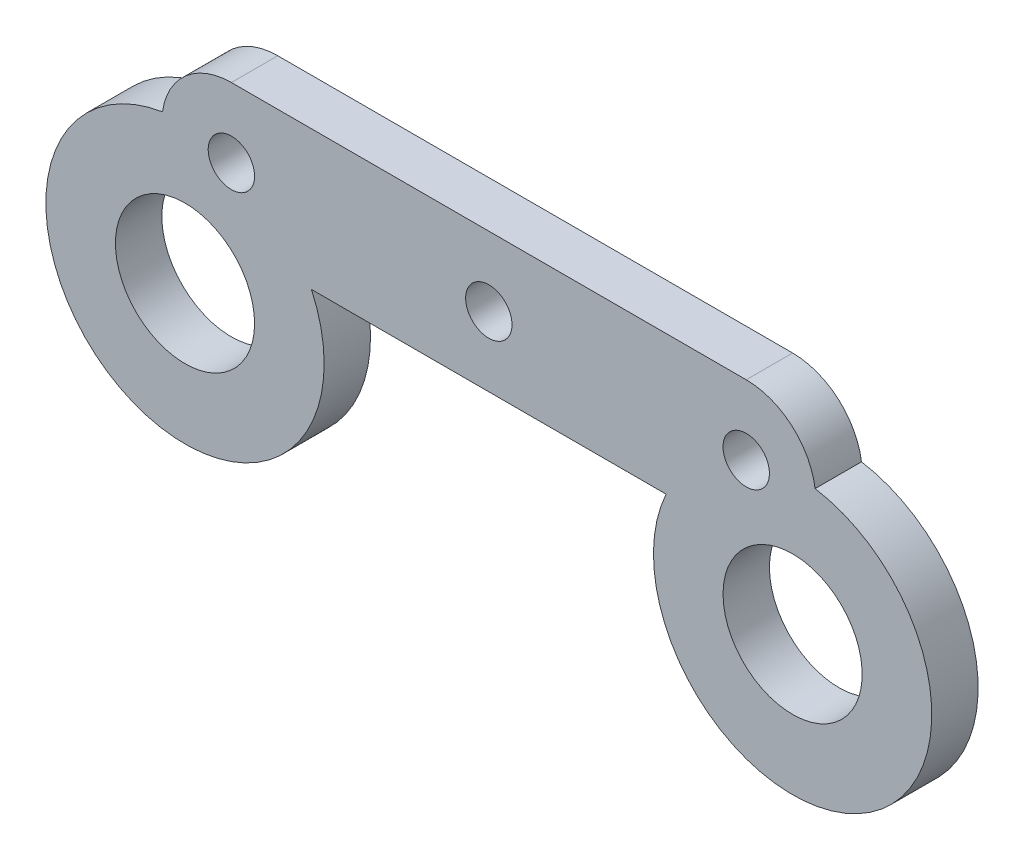
ISO-10303-21;
HEADER;
FILE_DESCRIPTION(('STEP AP214'),'2;1');
FILE_NAME('part.step','',(''),(''),'','','');
FILE_SCHEMA(('AUTOMOTIVE_DESIGN { 1 0 10303 214 1 1 1 1 }'));
ENDSEC;
DATA;
#1=APPLICATION_CONTEXT('core data for automotive mechanical design processes');
#2=APPLICATION_PROTOCOL_DEFINITION('international standard','automotive_design',2000,#1);
#3=PRODUCT_CONTEXT('',#1,'mechanical');
#4=PRODUCT('Part','Part','',(#3));
#5=PRODUCT_RELATED_PRODUCT_CATEGORY('part','',(#4));
#6=PRODUCT_DEFINITION_FORMATION('','',#4);
#7=PRODUCT_DEFINITION_CONTEXT('part definition',#1,'design');
#8=PRODUCT_DEFINITION('design','',#6,#7);
#9=PRODUCT_DEFINITION_SHAPE('','',#8);
#10=(LENGTH_UNIT() NAMED_UNIT(*) SI_UNIT(.MILLI.,.METRE.));
#11=(NAMED_UNIT(*) PLANE_ANGLE_UNIT() SI_UNIT($,.RADIAN.));
#12=(NAMED_UNIT(*) SI_UNIT($,.STERADIAN.) SOLID_ANGLE_UNIT());
#13=UNCERTAINTY_MEASURE_WITH_UNIT(LENGTH_MEASURE(1.E-05),#10,'distance_accuracy_value','');
#14=(GEOMETRIC_REPRESENTATION_CONTEXT(3) GLOBAL_UNCERTAINTY_ASSIGNED_CONTEXT((#13)) GLOBAL_UNIT_ASSIGNED_CONTEXT((#10,
#11,#12)) REPRESENTATION_CONTEXT('',''));
#15=CARTESIAN_POINT('',(0.,0.,0.));
#16=DIRECTION('',(0.,0.,1.));
#17=DIRECTION('',(1.,0.,0.));
#18=AXIS2_PLACEMENT_3D('',#15,#16,#17);
#19=CARTESIAN_POINT('',(11.1001903742504,0.,2.));
#20=DIRECTION('',(0.,0.,1.));
#21=DIRECTION('',(1.,0.,0.));
#22=AXIS2_PLACEMENT_3D('',#19,#20,#21);
#23=PLANE('',#22);
#24=CARTESIAN_POINT('',(-11.1001903742504,0.,2.));
#25=DIRECTION('',(0.,0.,1.));
#26=DIRECTION('',(1.,0.,0.));
#27=AXIS2_PLACEMENT_3D('',#24,#25,#26);
#28=CIRCLE('',#27,0.99999999999969);
#29=CARTESIAN_POINT('',(-10.1001903742507,0.,2.));
#30=VERTEX_POINT('',#29);
#31=EDGE_CURVE('E205',#30,#30,#28,.T.);
#32=ORIENTED_EDGE('',*,*,#31,.F.);
#33=EDGE_LOOP('',(#32));
#34=FACE_BOUND('',#33,.T.);
#35=CARTESIAN_POINT('',(13.1001903742511,-5.49999999999931,2.));
#36=DIRECTION('',(0.,0.,1.));
#37=DIRECTION('',(-1.,0.,0.));
#38=AXIS2_PLACEMENT_3D('',#35,#36,#37);
#39=CIRCLE('',#38,3.);
#40=CARTESIAN_POINT('',(10.1001903742511,-5.49999999999931,2.));
#41=VERTEX_POINT('',#40);
#42=EDGE_CURVE('E217',#41,#41,#39,.T.);
#43=ORIENTED_EDGE('',*,*,#42,.F.);
#44=EDGE_LOOP('',(#43));
#45=FACE_BOUND('',#44,.T.);
#46=CARTESIAN_POINT('',(11.1001903742504,0.,2.));
#47=DIRECTION('',(0.,0.,1.));
#48=DIRECTION('',(1.,0.,0.));
#49=AXIS2_PLACEMENT_3D('',#46,#47,#48);
#50=CIRCLE('',#49,3.);
#51=CARTESIAN_POINT('',(14.0705002353822,0.421021767683334,2.));
#52=VERTEX_POINT('',#51);
#53=CARTESIAN_POINT('',(11.1001903742504,3.,2.));
#54=VERTEX_POINT('',#53);
#55=EDGE_CURVE('E128',#52,#54,#50,.T.);
#56=ORIENTED_EDGE('',*,*,#55,.T.);
#57=DIRECTION('',(-1.,0.,0.));
#58=VECTOR('',#57,1.);
#59=CARTESIAN_POINT('',(-11.1001903742504,3.,2.));
#60=LINE('',#59,#58);
#61=CARTESIAN_POINT('',(-11.1001903742504,3.,2.));
#62=VERTEX_POINT('',#61);
#63=EDGE_CURVE('E86',#54,#62,#60,.T.);
#64=ORIENTED_EDGE('',*,*,#63,.T.);
#65=CARTESIAN_POINT('',(-11.1001903742504,0.,2.));
#66=DIRECTION('',(0.,0.,1.));
#67=DIRECTION('',(1.,0.,0.));
#68=AXIS2_PLACEMENT_3D('',#65,#66,#67);
#69=CIRCLE('',#68,3.);
#70=CARTESIAN_POINT('',(-14.0705002353822,0.421021767683246,2.));
#71=VERTEX_POINT('',#70);
#72=EDGE_CURVE('E99',#62,#71,#69,.T.);
#73=ORIENTED_EDGE('',*,*,#72,.T.);
#74=CARTESIAN_POINT('',(-13.100190374251,-5.49999999999942,2.));
#75=DIRECTION('',(0.,0.,1.));
#76=DIRECTION('',(1.,0.,0.));
#77=AXIS2_PLACEMENT_3D('',#74,#75,#76);
#78=CIRCLE('',#77,5.99999999999837);
#79=CARTESIAN_POINT('',(-7.64583431693467,-3.,2.));
#80=VERTEX_POINT('',#79);
#81=EDGE_CURVE('E93',#71,#80,#78,.T.);
#82=ORIENTED_EDGE('',*,*,#81,.T.);
#83=DIRECTION('',(1.,0.,0.));
#84=VECTOR('',#83,1.);
#85=CARTESIAN_POINT('',(-7.64583431693467,-3.,2.));
#86=LINE('',#85,#84);
#87=CARTESIAN_POINT('',(7.64583431693468,-3.,2.));
#88=VERTEX_POINT('',#87);
#89=EDGE_CURVE('E97',#80,#88,#86,.T.);
#90=ORIENTED_EDGE('',*,*,#89,.T.);
#91=CARTESIAN_POINT('',(13.1001903742511,-5.49999999999931,2.));
#92=DIRECTION('',(0.,0.,1.));
#93=DIRECTION('',(1.,0.,0.));
#94=AXIS2_PLACEMENT_3D('',#91,#92,#93);
#95=CIRCLE('',#94,5.99999999999833);
#96=EDGE_CURVE('E49',#88,#52,#95,.T.);
#97=ORIENTED_EDGE('',*,*,#96,.T.);
#98=EDGE_LOOP('',(#56,#64,#73,#82,#90,#97));
#99=FACE_BOUND('',#98,.T.);
#100=CARTESIAN_POINT('',(0.,0.,2.));
#101=DIRECTION('',(0.,0.,1.));
#102=DIRECTION('',(1.,0.,0.));
#103=AXIS2_PLACEMENT_3D('',#100,#101,#102);
#104=CIRCLE('',#103,1.);
#105=CARTESIAN_POINT('',(1.,0.,2.));
#106=VERTEX_POINT('',#105);
#107=EDGE_CURVE('E121',#106,#106,#104,.T.);
#108=ORIENTED_EDGE('',*,*,#107,.F.);
#109=EDGE_LOOP('',(#108));
#110=FACE_BOUND('',#109,.T.);
#111=CARTESIAN_POINT('',(-13.100190374251,-5.49999999999942,2.));
#112=DIRECTION('',(0.,0.,1.));
#113=DIRECTION('',(1.,0.,0.));
#114=AXIS2_PLACEMENT_3D('',#111,#112,#113);
#115=CIRCLE('',#114,3.);
#116=CARTESIAN_POINT('',(-10.100190374251,-5.49999999999942,2.));
#117=VERTEX_POINT('',#116);
#118=EDGE_CURVE('E211',#117,#117,#115,.T.);
#119=ORIENTED_EDGE('',*,*,#118,.F.);
#120=EDGE_LOOP('',(#119));
#121=FACE_BOUND('',#120,.T.);
#122=CARTESIAN_POINT('',(11.1001903742504,0.,2.));
#123=DIRECTION('',(0.,0.,1.));
#124=DIRECTION('',(-1.,0.,0.));
#125=AXIS2_PLACEMENT_3D('',#122,#123,#124);
#126=CIRCLE('',#125,1.00000000000028);
#127=CARTESIAN_POINT('',(10.1001903742501,0.,2.));
#128=VERTEX_POINT('',#127);
#129=EDGE_CURVE('E197',#128,#128,#126,.T.);
#130=ORIENTED_EDGE('',*,*,#129,.F.);
#131=EDGE_LOOP('',(#130));
#132=FACE_BOUND('',#131,.T.);
#133=ADVANCED_FACE('F32',(#34,#45,#99,#110,#121,#132),#23,.T.);
#134=CARTESIAN_POINT('',(11.1001903742504,0.,0.));
#135=DIRECTION('',(0.,0.,1.));
#136=DIRECTION('',(1.,0.,0.));
#137=AXIS2_PLACEMENT_3D('',#134,#135,#136);
#138=PLANE('',#137);
#139=CARTESIAN_POINT('',(-11.1001903742504,0.,0.));
#140=DIRECTION('',(0.,0.,1.));
#141=DIRECTION('',(1.,0.,0.));
#142=AXIS2_PLACEMENT_3D('',#139,#140,#141);
#143=CIRCLE('',#142,0.99999999999969);
#144=CARTESIAN_POINT('',(-10.1001903742507,0.,0.));
#145=VERTEX_POINT('',#144);
#146=EDGE_CURVE('E203',#145,#145,#143,.T.);
#147=ORIENTED_EDGE('',*,*,#146,.T.);
#148=EDGE_LOOP('',(#147));
#149=FACE_BOUND('',#148,.T.);
#150=CARTESIAN_POINT('',(13.1001903742511,-5.49999999999931,0.));
#151=DIRECTION('',(0.,0.,1.));
#152=DIRECTION('',(-1.,0.,0.));
#153=AXIS2_PLACEMENT_3D('',#150,#151,#152);
#154=CIRCLE('',#153,3.);
#155=CARTESIAN_POINT('',(10.1001903742511,-5.49999999999931,0.));
#156=VERTEX_POINT('',#155);
#157=EDGE_CURVE('E214',#156,#156,#154,.T.);
#158=ORIENTED_EDGE('',*,*,#157,.T.);
#159=EDGE_LOOP('',(#158));
#160=FACE_BOUND('',#159,.T.);
#161=CARTESIAN_POINT('',(11.1001903742504,0.,0.));
#162=DIRECTION('',(0.,0.,1.));
#163=DIRECTION('',(1.,0.,0.));
#164=AXIS2_PLACEMENT_3D('',#161,#162,#163);
#165=CIRCLE('',#164,3.);
#166=CARTESIAN_POINT('',(14.0705002353822,0.421021767683334,0.));
#167=VERTEX_POINT('',#166);
#168=CARTESIAN_POINT('',(11.1001903742504,3.,0.));
#169=VERTEX_POINT('',#168);
#170=EDGE_CURVE('E117',#167,#169,#165,.T.);
#171=ORIENTED_EDGE('',*,*,#170,.F.);
#172=CARTESIAN_POINT('',(13.1001903742511,-5.49999999999931,0.));
#173=DIRECTION('',(0.,0.,1.));
#174=DIRECTION('',(1.,0.,0.));
#175=AXIS2_PLACEMENT_3D('',#172,#173,#174);
#176=CIRCLE('',#175,5.99999999999833);
#177=CARTESIAN_POINT('',(7.64583431693468,-3.,0.));
#178=VERTEX_POINT('',#177);
#179=EDGE_CURVE('E78',#178,#167,#176,.T.);
#180=ORIENTED_EDGE('',*,*,#179,.F.);
#181=DIRECTION('',(1.,0.,0.));
#182=VECTOR('',#181,1.);
#183=CARTESIAN_POINT('',(-7.64583431693467,-3.,0.));
#184=LINE('',#183,#182);
#185=CARTESIAN_POINT('',(-7.64583431693467,-3.,0.));
#186=VERTEX_POINT('',#185);
#187=EDGE_CURVE('E72',#186,#178,#184,.T.);
#188=ORIENTED_EDGE('',*,*,#187,.F.);
#189=CARTESIAN_POINT('',(-13.100190374251,-5.49999999999942,0.));
#190=DIRECTION('',(0.,0.,1.));
#191=DIRECTION('',(1.,0.,0.));
#192=AXIS2_PLACEMENT_3D('',#189,#190,#191);
#193=CIRCLE('',#192,5.99999999999837);
#194=CARTESIAN_POINT('',(-14.0705002353822,0.421021767683246,0.));
#195=VERTEX_POINT('',#194);
#196=EDGE_CURVE('E107',#195,#186,#193,.T.);
#197=ORIENTED_EDGE('',*,*,#196,.F.);
#198=CARTESIAN_POINT('',(-11.1001903742504,0.,0.));
#199=DIRECTION('',(0.,0.,1.));
#200=DIRECTION('',(1.,0.,0.));
#201=AXIS2_PLACEMENT_3D('',#198,#199,#200);
#202=CIRCLE('',#201,3.);
#203=CARTESIAN_POINT('',(-11.1001903742504,3.,0.));
#204=VERTEX_POINT('',#203);
#205=EDGE_CURVE('E123',#204,#195,#202,.T.);
#206=ORIENTED_EDGE('',*,*,#205,.F.);
#207=DIRECTION('',(-1.,0.,0.));
#208=VECTOR('',#207,1.);
#209=CARTESIAN_POINT('',(-11.1001903742504,3.,0.));
#210=LINE('',#209,#208);
#211=EDGE_CURVE('E120',#169,#204,#210,.T.);
#212=ORIENTED_EDGE('',*,*,#211,.F.);
#213=EDGE_LOOP('',(#171,#180,#188,#197,#206,#212));
#214=FACE_BOUND('',#213,.T.);
#215=CARTESIAN_POINT('',(0.,0.,0.));
#216=DIRECTION('',(0.,0.,1.));
#217=DIRECTION('',(1.,0.,0.));
#218=AXIS2_PLACEMENT_3D('',#215,#216,#217);
#219=CIRCLE('',#218,1.);
#220=CARTESIAN_POINT('',(1.,0.,0.));
#221=VERTEX_POINT('',#220);
#222=EDGE_CURVE('E220',#221,#221,#219,.T.);
#223=ORIENTED_EDGE('',*,*,#222,.T.);
#224=EDGE_LOOP('',(#223));
#225=FACE_BOUND('',#224,.T.);
#226=CARTESIAN_POINT('',(-13.100190374251,-5.49999999999942,0.));
#227=DIRECTION('',(0.,0.,1.));
#228=DIRECTION('',(1.,0.,0.));
#229=AXIS2_PLACEMENT_3D('',#226,#227,#228);
#230=CIRCLE('',#229,3.);
#231=CARTESIAN_POINT('',(-10.100190374251,-5.49999999999942,0.));
#232=VERTEX_POINT('',#231);
#233=EDGE_CURVE('E208',#232,#232,#230,.T.);
#234=ORIENTED_EDGE('',*,*,#233,.T.);
#235=EDGE_LOOP('',(#234));
#236=FACE_BOUND('',#235,.T.);
#237=CARTESIAN_POINT('',(11.1001903742504,0.,0.));
#238=DIRECTION('',(0.,0.,1.));
#239=DIRECTION('',(-1.,0.,0.));
#240=AXIS2_PLACEMENT_3D('',#237,#238,#239);
#241=CIRCLE('',#240,1.00000000000028);
#242=CARTESIAN_POINT('',(10.1001903742501,0.,0.));
#243=VERTEX_POINT('',#242);
#244=EDGE_CURVE('E193',#243,#243,#241,.T.);
#245=ORIENTED_EDGE('',*,*,#244,.T.);
#246=EDGE_LOOP('',(#245));
#247=FACE_BOUND('',#246,.T.);
#248=ADVANCED_FACE('F137',(#149,#160,#214,#225,#236,#247),#138,.F.);
#249=CARTESIAN_POINT('',(11.1001903742504,0.,2.));
#250=DIRECTION('',(0.,0.,-1.));
#251=DIRECTION('',(-1.,0.,0.));
#252=AXIS2_PLACEMENT_3D('',#249,#250,#251);
#253=CYLINDRICAL_SURFACE('',#252,3.);
#254=ORIENTED_EDGE('',*,*,#170,.T.);
#255=DIRECTION('',(0.,0.,-1.));
#256=VECTOR('',#255,1.);
#257=CARTESIAN_POINT('',(11.1001903742504,3.,2.));
#258=LINE('',#257,#256);
#259=EDGE_CURVE('E11',#54,#169,#258,.T.);
#260=ORIENTED_EDGE('',*,*,#259,.F.);
#261=ORIENTED_EDGE('',*,*,#55,.F.);
#262=DIRECTION('',(0.,0.,-1.));
#263=VECTOR('',#262,1.);
#264=CARTESIAN_POINT('',(14.0705002353822,0.421021767683334,2.));
#265=LINE('',#264,#263);
#266=EDGE_CURVE('E113',#52,#167,#265,.T.);
#267=ORIENTED_EDGE('',*,*,#266,.T.);
#268=EDGE_LOOP('',(#254,#260,#261,#267));
#269=FACE_BOUND('',#268,.T.);
#270=ADVANCED_FACE('F34',(#269),#253,.T.);
#271=CARTESIAN_POINT('',(-11.1001903742504,3.,2.));
#272=DIRECTION('',(0.,-1.,0.));
#273=DIRECTION('',(0.,0.,-1.));
#274=AXIS2_PLACEMENT_3D('',#271,#272,#273);
#275=PLANE('',#274);
#276=ORIENTED_EDGE('',*,*,#211,.T.);
#277=DIRECTION('',(0.,0.,-1.));
#278=VECTOR('',#277,1.);
#279=CARTESIAN_POINT('',(-11.1001903742504,3.,2.));
#280=LINE('',#279,#278);
#281=EDGE_CURVE('E41',#62,#204,#280,.T.);
#282=ORIENTED_EDGE('',*,*,#281,.F.);
#283=ORIENTED_EDGE('',*,*,#63,.F.);
#284=ORIENTED_EDGE('',*,*,#259,.T.);
#285=EDGE_LOOP('',(#276,#282,#283,#284));
#286=FACE_BOUND('',#285,.T.);
#287=ADVANCED_FACE('F296',(#286),#275,.F.);
#288=CARTESIAN_POINT('',(-11.1001903742504,0.,2.));
#289=DIRECTION('',(0.,0.,-1.));
#290=DIRECTION('',(-1.,0.,0.));
#291=AXIS2_PLACEMENT_3D('',#288,#289,#290);
#292=CYLINDRICAL_SURFACE('',#291,3.);
#293=ORIENTED_EDGE('',*,*,#205,.T.);
#294=DIRECTION('',(0.,0.,-1.));
#295=VECTOR('',#294,1.);
#296=CARTESIAN_POINT('',(-14.0705002353822,0.421021767683246,2.));
#297=LINE('',#296,#295);
#298=EDGE_CURVE('E108',#71,#195,#297,.T.);
#299=ORIENTED_EDGE('',*,*,#298,.F.);
#300=ORIENTED_EDGE('',*,*,#72,.F.);
#301=ORIENTED_EDGE('',*,*,#281,.T.);
#302=EDGE_LOOP('',(#293,#299,#300,#301));
#303=FACE_BOUND('',#302,.T.);
#304=ADVANCED_FACE('F134',(#303),#292,.T.);
#305=CARTESIAN_POINT('',(-13.100190374251,-5.49999999999942,2.));
#306=DIRECTION('',(0.,0.,-1.));
#307=DIRECTION('',(-1.,0.,0.));
#308=AXIS2_PLACEMENT_3D('',#305,#306,#307);
#309=CYLINDRICAL_SURFACE('',#308,5.99999999999837);
#310=ORIENTED_EDGE('',*,*,#196,.T.);
#311=DIRECTION('',(0.,0.,-1.));
#312=VECTOR('',#311,1.);
#313=CARTESIAN_POINT('',(-7.64583431693467,-3.,2.));
#314=LINE('',#313,#312);
#315=EDGE_CURVE('E104',#80,#186,#314,.T.);
#316=ORIENTED_EDGE('',*,*,#315,.F.);
#317=ORIENTED_EDGE('',*,*,#81,.F.);
#318=ORIENTED_EDGE('',*,*,#298,.T.);
#319=EDGE_LOOP('',(#310,#316,#317,#318));
#320=FACE_BOUND('',#319,.T.);
#321=ADVANCED_FACE('F105',(#320),#309,.T.);
#322=CARTESIAN_POINT('',(-7.64583431693467,-3.,2.));
#323=DIRECTION('',(0.,1.,0.));
#324=DIRECTION('',(0.,0.,1.));
#325=AXIS2_PLACEMENT_3D('',#322,#323,#324);
#326=PLANE('',#325);
#327=CARTESIAN_POINT('',(0.,-3.,1.));
#328=DIRECTION('',(0.,-1.,0.));
#329=DIRECTION('',(0.,0.,-1.));
#330=AXIS2_PLACEMENT_3D('',#327,#328,#329);
#331=CIRCLE('',#330,0.5);
#332=CARTESIAN_POINT('',(0.,-3.,0.5));
#333=VERTEX_POINT('',#332);
#334=EDGE_CURVE('E194',#333,#333,#331,.T.);
#335=ORIENTED_EDGE('',*,*,#334,.F.);
#336=EDGE_LOOP('',(#335));
#337=FACE_BOUND('',#336,.T.);
#338=ORIENTED_EDGE('',*,*,#187,.T.);
#339=DIRECTION('',(0.,0.,-1.));
#340=VECTOR('',#339,1.);
#341=CARTESIAN_POINT('',(7.64583431693468,-3.,2.));
#342=LINE('',#341,#340);
#343=EDGE_CURVE('E109',#88,#178,#342,.T.);
#344=ORIENTED_EDGE('',*,*,#343,.F.);
#345=ORIENTED_EDGE('',*,*,#89,.F.);
#346=ORIENTED_EDGE('',*,*,#315,.T.);
#347=EDGE_LOOP('',(#338,#344,#345,#346));
#348=FACE_BOUND('',#347,.T.);
#349=ADVANCED_FACE('F111',(#337,#348),#326,.F.);
#350=CARTESIAN_POINT('',(13.1001903742511,-5.49999999999931,2.));
#351=DIRECTION('',(0.,0.,-1.));
#352=DIRECTION('',(-1.,0.,0.));
#353=AXIS2_PLACEMENT_3D('',#350,#351,#352);
#354=CYLINDRICAL_SURFACE('',#353,5.99999999999833);
#355=ORIENTED_EDGE('',*,*,#179,.T.);
#356=ORIENTED_EDGE('',*,*,#266,.F.);
#357=ORIENTED_EDGE('',*,*,#96,.F.);
#358=ORIENTED_EDGE('',*,*,#343,.T.);
#359=EDGE_LOOP('',(#355,#356,#357,#358));
#360=FACE_BOUND('',#359,.T.);
#361=ADVANCED_FACE('F142',(#360),#354,.T.);
#362=CARTESIAN_POINT('',(0.,0.,2.));
#363=DIRECTION('',(0.,0.,-1.));
#364=DIRECTION('',(-1.,0.,0.));
#365=AXIS2_PLACEMENT_3D('',#362,#363,#364);
#366=CYLINDRICAL_SURFACE('',#365,1.);
#367=ORIENTED_EDGE('',*,*,#107,.T.);
#368=EDGE_LOOP('',(#367));
#369=FACE_BOUND('',#368,.T.);
#370=ORIENTED_EDGE('',*,*,#222,.F.);
#371=EDGE_LOOP('',(#370));
#372=FACE_BOUND('',#371,.T.);
#373=ADVANCED_FACE('F144',(#369,#372),#366,.F.);
#374=CARTESIAN_POINT('',(13.1001903742511,-5.49999999999931,2.));
#375=DIRECTION('',(0.,0.,-1.));
#376=DIRECTION('',(-1.,0.,0.));
#377=AXIS2_PLACEMENT_3D('',#374,#375,#376);
#378=CYLINDRICAL_SURFACE('',#377,3.);
#379=ORIENTED_EDGE('',*,*,#42,.T.);
#380=EDGE_LOOP('',(#379));
#381=FACE_BOUND('',#380,.T.);
#382=ORIENTED_EDGE('',*,*,#157,.F.);
#383=EDGE_LOOP('',(#382));
#384=FACE_BOUND('',#383,.T.);
#385=ADVANCED_FACE('F150',(#381,#384),#378,.F.);
#386=CARTESIAN_POINT('',(-13.100190374251,-5.49999999999942,2.));
#387=DIRECTION('',(0.,0.,-1.));
#388=DIRECTION('',(-1.,0.,0.));
#389=AXIS2_PLACEMENT_3D('',#386,#387,#388);
#390=CYLINDRICAL_SURFACE('',#389,3.);
#391=ORIENTED_EDGE('',*,*,#118,.T.);
#392=EDGE_LOOP('',(#391));
#393=FACE_BOUND('',#392,.T.);
#394=ORIENTED_EDGE('',*,*,#233,.F.);
#395=EDGE_LOOP('',(#394));
#396=FACE_BOUND('',#395,.T.);
#397=ADVANCED_FACE('F168',(#393,#396),#390,.F.);
#398=CARTESIAN_POINT('',(-11.1001903742504,0.,2.));
#399=DIRECTION('',(0.,0.,-1.));
#400=DIRECTION('',(-1.,0.,0.));
#401=AXIS2_PLACEMENT_3D('',#398,#399,#400);
#402=CYLINDRICAL_SURFACE('',#401,0.99999999999969);
#403=ORIENTED_EDGE('',*,*,#31,.T.);
#404=EDGE_LOOP('',(#403));
#405=FACE_BOUND('',#404,.T.);
#406=ORIENTED_EDGE('',*,*,#146,.F.);
#407=EDGE_LOOP('',(#406));
#408=FACE_BOUND('',#407,.T.);
#409=ADVANCED_FACE('F172',(#405,#408),#402,.F.);
#410=CARTESIAN_POINT('',(11.1001903742504,0.,2.));
#411=DIRECTION('',(0.,0.,-1.));
#412=DIRECTION('',(-1.,0.,0.));
#413=AXIS2_PLACEMENT_3D('',#410,#411,#412);
#414=CYLINDRICAL_SURFACE('',#413,1.00000000000028);
#415=ORIENTED_EDGE('',*,*,#129,.T.);
#416=EDGE_LOOP('',(#415));
#417=FACE_BOUND('',#416,.T.);
#418=ORIENTED_EDGE('',*,*,#244,.F.);
#419=EDGE_LOOP('',(#418));
#420=FACE_BOUND('',#419,.T.);
#421=ADVANCED_FACE('F176',(#417,#420),#414,.F.);
#422=CARTESIAN_POINT('',(0.,-2.5,1.));
#423=DIRECTION('',(0.,-1.,0.));
#424=DIRECTION('',(0.,0.,-1.));
#425=AXIS2_PLACEMENT_3D('',#422,#423,#424);
#426=CYLINDRICAL_SURFACE('',#425,0.5);
#427=CARTESIAN_POINT('',(0.,-2.5,1.));
#428=DIRECTION('',(0.,-1.,0.));
#429=DIRECTION('',(0.,0.,-1.));
#430=AXIS2_PLACEMENT_3D('',#427,#428,#429);
#431=CIRCLE('',#430,0.5);
#432=CARTESIAN_POINT('',(0.,-2.5,0.5));
#433=VERTEX_POINT('',#432);
#434=EDGE_CURVE('E192',#433,#433,#431,.T.);
#435=ORIENTED_EDGE('',*,*,#434,.F.);
#436=EDGE_LOOP('',(#435));
#437=FACE_BOUND('',#436,.T.);
#438=ORIENTED_EDGE('',*,*,#334,.T.);
#439=EDGE_LOOP('',(#438));
#440=FACE_BOUND('',#439,.T.);
#441=ADVANCED_FACE('F180',(#437,#440),#426,.F.);
#442=CARTESIAN_POINT('',(0.,-2.5,1.));
#443=DIRECTION('',(0.,-1.,0.));
#444=DIRECTION('',(0.,0.,-1.));
#445=AXIS2_PLACEMENT_3D('',#442,#443,#444);
#446=PLANE('',#445);
#447=ORIENTED_EDGE('',*,*,#434,.T.);
#448=EDGE_LOOP('',(#447));
#449=FACE_BOUND('',#448,.T.);
#450=ADVANCED_FACE('F184',(#449),#446,.T.);
#451=CLOSED_SHELL('',(#133,#248,#270,#287,#304,#321,#349,#361,#373,#385,#397,#409,#421,#441,#450));
#452=MANIFOLD_SOLID_BREP('B2',#451);
#453=ADVANCED_BREP_SHAPE_REPRESENTATION('',(#18,#452),#14);
#454=SHAPE_DEFINITION_REPRESENTATION(#9,#453);
ENDSEC;
END-ISO-10303-21;
